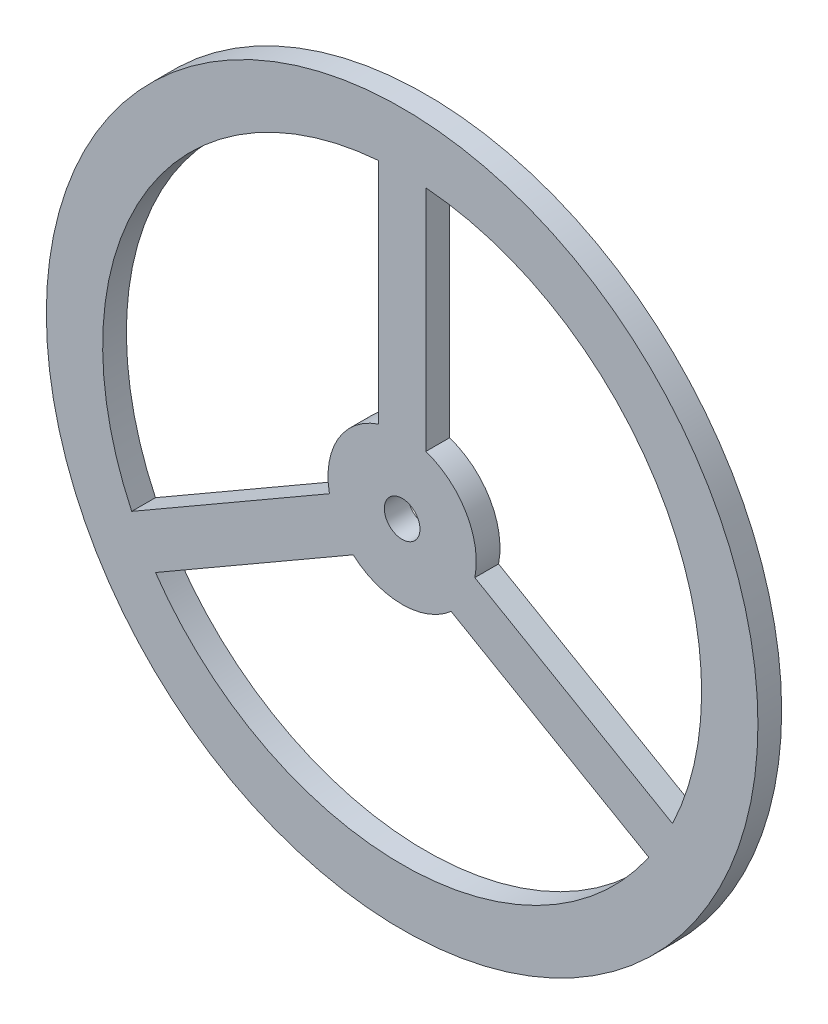
ISO-10303-21;
HEADER;
FILE_DESCRIPTION(('STEP AP214'),'2;1');
FILE_NAME('part.step','',(''),(''),'','','');
FILE_SCHEMA(('AUTOMOTIVE_DESIGN { 1 0 10303 214 1 1 1 1 }'));
ENDSEC;
DATA;
#1=APPLICATION_CONTEXT('core data for automotive mechanical design processes');
#2=APPLICATION_PROTOCOL_DEFINITION('international standard','automotive_design',2000,#1);
#3=PRODUCT_CONTEXT('',#1,'mechanical');
#4=PRODUCT('Part','Part','',(#3));
#5=PRODUCT_RELATED_PRODUCT_CATEGORY('part','',(#4));
#6=PRODUCT_DEFINITION_FORMATION('','',#4);
#7=PRODUCT_DEFINITION_CONTEXT('part definition',#1,'design');
#8=PRODUCT_DEFINITION('design','',#6,#7);
#9=PRODUCT_DEFINITION_SHAPE('','',#8);
#10=(LENGTH_UNIT() NAMED_UNIT(*) SI_UNIT(.MILLI.,.METRE.));
#11=(NAMED_UNIT(*) PLANE_ANGLE_UNIT() SI_UNIT($,.RADIAN.));
#12=(NAMED_UNIT(*) SI_UNIT($,.STERADIAN.) SOLID_ANGLE_UNIT());
#13=UNCERTAINTY_MEASURE_WITH_UNIT(LENGTH_MEASURE(1.E-05),#10,'distance_accuracy_value','');
#14=(GEOMETRIC_REPRESENTATION_CONTEXT(3) GLOBAL_UNCERTAINTY_ASSIGNED_CONTEXT((#13)) GLOBAL_UNIT_ASSIGNED_CONTEXT((#10,
#11,#12)) REPRESENTATION_CONTEXT('',''));
#15=CARTESIAN_POINT('',(0.,0.,0.));
#16=DIRECTION('',(0.,0.,1.));
#17=DIRECTION('',(1.,0.,0.));
#18=AXIS2_PLACEMENT_3D('',#15,#16,#17);
#19=CARTESIAN_POINT('',(0.,0.,4.));
#20=DIRECTION('',(0.,0.,1.));
#21=DIRECTION('',(1.,0.,0.));
#22=AXIS2_PLACEMENT_3D('',#19,#20,#21);
#23=PLANE('',#22);
#24=CARTESIAN_POINT('',(0.,0.,4.));
#25=DIRECTION('',(0.,0.,1.));
#26=DIRECTION('',(1.,0.,0.));
#27=AXIS2_PLACEMENT_3D('',#24,#25,#26);
#28=CIRCLE('',#27,60.);
#29=CARTESIAN_POINT('',(60.,0.,4.));
#30=VERTEX_POINT('',#29);
#31=EDGE_CURVE('E11',#30,#30,#28,.T.);
#32=ORIENTED_EDGE('',*,*,#31,.T.);
#33=EDGE_LOOP('',(#32));
#34=FACE_BOUND('',#33,.T.);
#35=CARTESIAN_POINT('',(0.,0.,4.));
#36=DIRECTION('',(0.,0.,1.));
#37=DIRECTION('',(1.,0.,0.));
#38=AXIS2_PLACEMENT_3D('',#35,#36,#37);
#39=CIRCLE('',#38,3.);
#40=CARTESIAN_POINT('',(3.,0.,4.));
#41=VERTEX_POINT('',#40);
#42=EDGE_CURVE('E220',#41,#41,#39,.T.);
#43=ORIENTED_EDGE('',*,*,#42,.F.);
#44=EDGE_LOOP('',(#43));
#45=FACE_BOUND('',#44,.T.);
#46=DIRECTION('',(0.,1.,0.));
#47=VECTOR('',#46,1.);
#48=CARTESIAN_POINT('',(-4.,11.842719282327,4.));
#49=LINE('',#48,#47);
#50=CARTESIAN_POINT('',(-4.,11.842719282327,4.));
#51=VERTEX_POINT('',#50);
#52=CARTESIAN_POINT('',(-4.,50.3413349048275,4.));
#53=VERTEX_POINT('',#52);
#54=EDGE_CURVE('E191',#51,#53,#49,.T.);
#55=ORIENTED_EDGE('',*,*,#54,.F.);
#56=CARTESIAN_POINT('',(0.,0.,4.));
#57=DIRECTION('',(0.,0.,-1.));
#58=DIRECTION('',(1.,0.,0.));
#59=AXIS2_PLACEMENT_3D('',#56,#57,#58);
#60=CIRCLE('',#59,12.5);
#61=CARTESIAN_POINT('',(-12.256095748383,-2.45725802602564,4.));
#62=VERTEX_POINT('',#61);
#63=EDGE_CURVE('E189',#62,#51,#60,.T.);
#64=ORIENTED_EDGE('',*,*,#63,.F.);
#65=DIRECTION('',(0.866025403784437,0.500000000000003,0.));
#66=VECTOR('',#65,1.);
#67=CARTESIAN_POINT('',(-12.256095748383,-2.45725802602564,4.));
#68=LINE('',#67,#66);
#69=CARTESIAN_POINT('',(-45.5968748880009,-21.706565837276,4.));
#70=VERTEX_POINT('',#69);
#71=EDGE_CURVE('E197',#70,#62,#68,.T.);
#72=ORIENTED_EDGE('',*,*,#71,.F.);
#73=CARTESIAN_POINT('',(0.,0.,4.));
#74=DIRECTION('',(0.,0.,1.));
#75=DIRECTION('',(1.,0.,0.));
#76=AXIS2_PLACEMENT_3D('',#73,#74,#75);
#77=CIRCLE('',#76,50.5);
#78=EDGE_CURVE('E194',#53,#70,#77,.T.);
#79=ORIENTED_EDGE('',*,*,#78,.F.);
#80=EDGE_LOOP('',(#55,#64,#72,#79));
#81=FACE_BOUND('',#80,.T.);
#82=DIRECTION('',(0.866025403784439,-0.499999999999998,0.));
#83=VECTOR('',#82,1.);
#84=CARTESIAN_POINT('',(12.256095748383,-2.45725802602581,4.));
#85=LINE('',#84,#83);
#86=CARTESIAN_POINT('',(12.256095748383,-2.45725802602581,4.));
#87=VERTEX_POINT('',#86);
#88=CARTESIAN_POINT('',(45.5968748880009,-21.706565837276,4.));
#89=VERTEX_POINT('',#88);
#90=EDGE_CURVE('E160',#87,#89,#85,.T.);
#91=ORIENTED_EDGE('',*,*,#90,.F.);
#92=CARTESIAN_POINT('',(0.,0.,4.));
#93=DIRECTION('',(0.,0.,-1.));
#94=DIRECTION('',(1.,0.,0.));
#95=AXIS2_PLACEMENT_3D('',#92,#93,#94);
#96=CIRCLE('',#95,12.5);
#97=CARTESIAN_POINT('',(4.,11.842719282327,4.));
#98=VERTEX_POINT('',#97);
#99=EDGE_CURVE('E158',#98,#87,#96,.T.);
#100=ORIENTED_EDGE('',*,*,#99,.F.);
#101=DIRECTION('',(0.,-1.,0.));
#102=VECTOR('',#101,1.);
#103=CARTESIAN_POINT('',(4.,11.842719282327,4.));
#104=LINE('',#103,#102);
#105=CARTESIAN_POINT('',(4.,50.3413349048275,4.));
#106=VERTEX_POINT('',#105);
#107=EDGE_CURVE('E166',#106,#98,#104,.T.);
#108=ORIENTED_EDGE('',*,*,#107,.F.);
#109=CARTESIAN_POINT('',(0.,0.,4.));
#110=DIRECTION('',(0.,0.,1.));
#111=DIRECTION('',(1.,0.,0.));
#112=AXIS2_PLACEMENT_3D('',#109,#110,#111);
#113=CIRCLE('',#112,50.5);
#114=EDGE_CURVE('E163',#89,#106,#113,.T.);
#115=ORIENTED_EDGE('',*,*,#114,.F.);
#116=EDGE_LOOP('',(#91,#100,#108,#115));
#117=FACE_BOUND('',#116,.T.);
#118=DIRECTION('',(-0.866025403784437,-0.500000000000003,0.));
#119=VECTOR('',#118,1.);
#120=CARTESIAN_POINT('',(-8.2560957483831,-9.38546125630118,4.));
#121=LINE('',#120,#119);
#122=CARTESIAN_POINT('',(-8.2560957483831,-9.38546125630118,4.));
#123=VERTEX_POINT('',#122);
#124=CARTESIAN_POINT('',(-41.5968748880009,-28.6347690675515,4.));
#125=VERTEX_POINT('',#124);
#126=EDGE_CURVE('E130',#123,#125,#121,.T.);
#127=ORIENTED_EDGE('',*,*,#126,.F.);
#128=CARTESIAN_POINT('',(0.,0.,4.));
#129=DIRECTION('',(0.,0.,-1.));
#130=DIRECTION('',(1.,0.,0.));
#131=AXIS2_PLACEMENT_3D('',#128,#129,#130);
#132=CIRCLE('',#131,12.5);
#133=CARTESIAN_POINT('',(8.25609574838296,-9.3854612563013,4.));
#134=VERTEX_POINT('',#133);
#135=EDGE_CURVE('E122',#134,#123,#132,.T.);
#136=ORIENTED_EDGE('',*,*,#135,.F.);
#137=DIRECTION('',(-0.86602540378444,0.499999999999999,0.));
#138=VECTOR('',#137,1.);
#139=CARTESIAN_POINT('',(8.25609574838296,-9.3854612563013,4.));
#140=LINE('',#139,#138);
#141=CARTESIAN_POINT('',(41.5968748880009,-28.6347690675515,4.));
#142=VERTEX_POINT('',#141);
#143=EDGE_CURVE('E144',#142,#134,#140,.T.);
#144=ORIENTED_EDGE('',*,*,#143,.F.);
#145=CARTESIAN_POINT('',(0.,0.,4.));
#146=DIRECTION('',(0.,0.,1.));
#147=DIRECTION('',(1.,0.,0.));
#148=AXIS2_PLACEMENT_3D('',#145,#146,#147);
#149=CIRCLE('',#148,50.5);
#150=EDGE_CURVE('E142',#125,#142,#149,.T.);
#151=ORIENTED_EDGE('',*,*,#150,.F.);
#152=EDGE_LOOP('',(#127,#136,#144,#151));
#153=FACE_BOUND('',#152,.T.);
#154=ADVANCED_FACE('F33',(#34,#45,#81,#117,#153),#23,.T.);
#155=CARTESIAN_POINT('',(0.,0.,0.));
#156=DIRECTION('',(0.,0.,1.));
#157=DIRECTION('',(1.,0.,0.));
#158=AXIS2_PLACEMENT_3D('',#155,#156,#157);
#159=PLANE('',#158);
#160=CARTESIAN_POINT('',(0.,0.,0.));
#161=DIRECTION('',(0.,0.,-1.));
#162=DIRECTION('',(1.,0.,0.));
#163=AXIS2_PLACEMENT_3D('',#160,#161,#162);
#164=CIRCLE('',#163,12.5);
#165=CARTESIAN_POINT('',(4.,11.842719282327,0.));
#166=VERTEX_POINT('',#165);
#167=CARTESIAN_POINT('',(12.256095748383,-2.45725802602581,0.));
#168=VERTEX_POINT('',#167);
#169=EDGE_CURVE('E138',#166,#168,#164,.T.);
#170=ORIENTED_EDGE('',*,*,#169,.T.);
#171=DIRECTION('',(0.866025403784439,-0.499999999999998,0.));
#172=VECTOR('',#171,1.);
#173=CARTESIAN_POINT('',(12.256095748383,-2.45725802602581,0.));
#174=LINE('',#173,#172);
#175=CARTESIAN_POINT('',(45.5968748880009,-21.706565837276,0.));
#176=VERTEX_POINT('',#175);
#177=EDGE_CURVE('E171',#168,#176,#174,.T.);
#178=ORIENTED_EDGE('',*,*,#177,.T.);
#179=CARTESIAN_POINT('',(0.,0.,0.));
#180=DIRECTION('',(0.,0.,1.));
#181=DIRECTION('',(1.,0.,0.));
#182=AXIS2_PLACEMENT_3D('',#179,#180,#181);
#183=CIRCLE('',#182,50.5);
#184=CARTESIAN_POINT('',(4.,50.3413349048275,0.));
#185=VERTEX_POINT('',#184);
#186=EDGE_CURVE('E174',#176,#185,#183,.T.);
#187=ORIENTED_EDGE('',*,*,#186,.T.);
#188=DIRECTION('',(0.,-1.,0.));
#189=VECTOR('',#188,1.);
#190=CARTESIAN_POINT('',(4.,11.842719282327,0.));
#191=LINE('',#190,#189);
#192=EDGE_CURVE('E161',#185,#166,#191,.T.);
#193=ORIENTED_EDGE('',*,*,#192,.T.);
#194=EDGE_LOOP('',(#170,#178,#187,#193));
#195=FACE_BOUND('',#194,.T.);
#196=CARTESIAN_POINT('',(0.,0.,0.));
#197=DIRECTION('',(0.,0.,1.));
#198=DIRECTION('',(1.,0.,0.));
#199=AXIS2_PLACEMENT_3D('',#196,#197,#198);
#200=CIRCLE('',#199,3.);
#201=CARTESIAN_POINT('',(3.,0.,0.));
#202=VERTEX_POINT('',#201);
#203=EDGE_CURVE('E219',#202,#202,#200,.T.);
#204=ORIENTED_EDGE('',*,*,#203,.T.);
#205=EDGE_LOOP('',(#204));
#206=FACE_BOUND('',#205,.T.);
#207=CARTESIAN_POINT('',(0.,0.,0.));
#208=DIRECTION('',(0.,0.,1.));
#209=DIRECTION('',(1.,0.,0.));
#210=AXIS2_PLACEMENT_3D('',#207,#208,#209);
#211=CIRCLE('',#210,60.);
#212=CARTESIAN_POINT('',(60.,0.,0.));
#213=VERTEX_POINT('',#212);
#214=EDGE_CURVE('E37',#213,#213,#211,.T.);
#215=ORIENTED_EDGE('',*,*,#214,.F.);
#216=EDGE_LOOP('',(#215));
#217=FACE_BOUND('',#216,.T.);
#218=CARTESIAN_POINT('',(0.,0.,0.));
#219=DIRECTION('',(0.,0.,-1.));
#220=DIRECTION('',(1.,0.,0.));
#221=AXIS2_PLACEMENT_3D('',#218,#219,#220);
#222=CIRCLE('',#221,12.5);
#223=CARTESIAN_POINT('',(-12.256095748383,-2.45725802602563,0.));
#224=VERTEX_POINT('',#223);
#225=CARTESIAN_POINT('',(-4.,11.842719282327,0.));
#226=VERTEX_POINT('',#225);
#227=EDGE_CURVE('E188',#224,#226,#222,.T.);
#228=ORIENTED_EDGE('',*,*,#227,.T.);
#229=DIRECTION('',(0.,1.,0.));
#230=VECTOR('',#229,1.);
#231=CARTESIAN_POINT('',(-4.,11.842719282327,0.));
#232=LINE('',#231,#230);
#233=CARTESIAN_POINT('',(-4.,50.3413349048275,0.));
#234=VERTEX_POINT('',#233);
#235=EDGE_CURVE('E202',#226,#234,#232,.T.);
#236=ORIENTED_EDGE('',*,*,#235,.T.);
#237=CARTESIAN_POINT('',(0.,0.,0.));
#238=DIRECTION('',(0.,0.,1.));
#239=DIRECTION('',(1.,0.,0.));
#240=AXIS2_PLACEMENT_3D('',#237,#238,#239);
#241=CIRCLE('',#240,50.5);
#242=CARTESIAN_POINT('',(-45.5968748880009,-21.706565837276,0.));
#243=VERTEX_POINT('',#242);
#244=EDGE_CURVE('E205',#234,#243,#241,.T.);
#245=ORIENTED_EDGE('',*,*,#244,.T.);
#246=DIRECTION('',(0.866025403784437,0.500000000000003,0.));
#247=VECTOR('',#246,1.);
#248=CARTESIAN_POINT('',(-12.256095748383,-2.45725802602564,0.));
#249=LINE('',#248,#247);
#250=EDGE_CURVE('E192',#243,#224,#249,.T.);
#251=ORIENTED_EDGE('',*,*,#250,.T.);
#252=EDGE_LOOP('',(#228,#236,#245,#251));
#253=FACE_BOUND('',#252,.T.);
#254=CARTESIAN_POINT('',(0.,0.,0.));
#255=DIRECTION('',(0.,0.,-1.));
#256=DIRECTION('',(1.,0.,0.));
#257=AXIS2_PLACEMENT_3D('',#254,#255,#256);
#258=CIRCLE('',#257,12.5);
#259=CARTESIAN_POINT('',(8.25609574838296,-9.3854612563013,0.));
#260=VERTEX_POINT('',#259);
#261=CARTESIAN_POINT('',(-8.2560957483831,-9.38546125630118,0.));
#262=VERTEX_POINT('',#261);
#263=EDGE_CURVE('E56',#260,#262,#258,.T.);
#264=ORIENTED_EDGE('',*,*,#263,.T.);
#265=DIRECTION('',(-0.866025403784437,-0.500000000000003,0.));
#266=VECTOR('',#265,1.);
#267=CARTESIAN_POINT('',(-8.2560957483831,-9.38546125630118,0.));
#268=LINE('',#267,#266);
#269=CARTESIAN_POINT('',(-41.5968748880009,-28.6347690675515,0.));
#270=VERTEX_POINT('',#269);
#271=EDGE_CURVE('E137',#262,#270,#268,.T.);
#272=ORIENTED_EDGE('',*,*,#271,.T.);
#273=CARTESIAN_POINT('',(0.,0.,0.));
#274=DIRECTION('',(0.,0.,1.));
#275=DIRECTION('',(1.,0.,0.));
#276=AXIS2_PLACEMENT_3D('',#273,#274,#275);
#277=CIRCLE('',#276,50.5);
#278=CARTESIAN_POINT('',(41.5968748880009,-28.6347690675515,0.));
#279=VERTEX_POINT('',#278);
#280=EDGE_CURVE('E150',#270,#279,#277,.T.);
#281=ORIENTED_EDGE('',*,*,#280,.T.);
#282=DIRECTION('',(-0.86602540378444,0.499999999999999,0.));
#283=VECTOR('',#282,1.);
#284=CARTESIAN_POINT('',(8.25609574838296,-9.3854612563013,0.));
#285=LINE('',#284,#283);
#286=EDGE_CURVE('E131',#279,#260,#285,.T.);
#287=ORIENTED_EDGE('',*,*,#286,.T.);
#288=EDGE_LOOP('',(#264,#272,#281,#287));
#289=FACE_BOUND('',#288,.T.);
#290=ADVANCED_FACE('F226',(#195,#206,#217,#253,#289),#159,.F.);
#291=CARTESIAN_POINT('',(0.,0.,4.));
#292=DIRECTION('',(0.,0.,-1.));
#293=DIRECTION('',(-1.,0.,0.));
#294=AXIS2_PLACEMENT_3D('',#291,#292,#293);
#295=CYLINDRICAL_SURFACE('',#294,60.);
#296=ORIENTED_EDGE('',*,*,#31,.F.);
#297=EDGE_LOOP('',(#296));
#298=FACE_BOUND('',#297,.T.);
#299=ORIENTED_EDGE('',*,*,#214,.T.);
#300=EDGE_LOOP('',(#299));
#301=FACE_BOUND('',#300,.T.);
#302=ADVANCED_FACE('F35',(#298,#301),#295,.T.);
#303=CARTESIAN_POINT('',(0.,0.,4.));
#304=DIRECTION('',(0.,0.,-1.));
#305=DIRECTION('',(-1.,0.,0.));
#306=AXIS2_PLACEMENT_3D('',#303,#304,#305);
#307=CYLINDRICAL_SURFACE('',#306,3.);
#308=ORIENTED_EDGE('',*,*,#42,.T.);
#309=EDGE_LOOP('',(#308));
#310=FACE_BOUND('',#309,.T.);
#311=ORIENTED_EDGE('',*,*,#203,.F.);
#312=EDGE_LOOP('',(#311));
#313=FACE_BOUND('',#312,.T.);
#314=ADVANCED_FACE('F229',(#310,#313),#307,.F.);
#315=CARTESIAN_POINT('',(0.,0.,4.));
#316=DIRECTION('',(0.,0.,-1.));
#317=DIRECTION('',(-1.,0.,0.));
#318=AXIS2_PLACEMENT_3D('',#315,#316,#317);
#319=CYLINDRICAL_SURFACE('',#318,12.5);
#320=ORIENTED_EDGE('',*,*,#227,.F.);
#321=DIRECTION('',(0.,0.,-1.));
#322=VECTOR('',#321,1.);
#323=CARTESIAN_POINT('',(-12.256095748383,-2.45725802602564,4.));
#324=LINE('',#323,#322);
#325=EDGE_CURVE('E199',#62,#224,#324,.T.);
#326=ORIENTED_EDGE('',*,*,#325,.F.);
#327=ORIENTED_EDGE('',*,*,#63,.T.);
#328=DIRECTION('',(0.,0.,-1.));
#329=VECTOR('',#328,1.);
#330=CARTESIAN_POINT('',(-4.,11.842719282327,4.));
#331=LINE('',#330,#329);
#332=EDGE_CURVE('E216',#51,#226,#331,.T.);
#333=ORIENTED_EDGE('',*,*,#332,.T.);
#334=EDGE_LOOP('',(#320,#326,#327,#333));
#335=FACE_BOUND('',#334,.T.);
#336=ADVANCED_FACE('F231',(#335),#319,.T.);
#337=CARTESIAN_POINT('',(-4.,11.842719282327,4.));
#338=DIRECTION('',(-1.,0.,0.));
#339=DIRECTION('',(0.,0.,1.));
#340=AXIS2_PLACEMENT_3D('',#337,#338,#339);
#341=PLANE('',#340);
#342=ORIENTED_EDGE('',*,*,#235,.F.);
#343=ORIENTED_EDGE('',*,*,#332,.F.);
#344=ORIENTED_EDGE('',*,*,#54,.T.);
#345=DIRECTION('',(0.,0.,-1.));
#346=VECTOR('',#345,1.);
#347=CARTESIAN_POINT('',(-4.,50.3413349048275,4.));
#348=LINE('',#347,#346);
#349=EDGE_CURVE('E214',#53,#234,#348,.T.);
#350=ORIENTED_EDGE('',*,*,#349,.T.);
#351=EDGE_LOOP('',(#342,#343,#344,#350));
#352=FACE_BOUND('',#351,.T.);
#353=ADVANCED_FACE('F238',(#352),#341,.T.);
#354=CARTESIAN_POINT('',(0.,0.,4.));
#355=DIRECTION('',(0.,0.,-1.));
#356=DIRECTION('',(-1.,0.,0.));
#357=AXIS2_PLACEMENT_3D('',#354,#355,#356);
#358=CYLINDRICAL_SURFACE('',#357,50.5);
#359=ORIENTED_EDGE('',*,*,#244,.F.);
#360=ORIENTED_EDGE('',*,*,#349,.F.);
#361=ORIENTED_EDGE('',*,*,#78,.T.);
#362=DIRECTION('',(0.,0.,-1.));
#363=VECTOR('',#362,1.);
#364=CARTESIAN_POINT('',(-45.5968748880009,-21.706565837276,4.));
#365=LINE('',#364,#363);
#366=EDGE_CURVE('E212',#70,#243,#365,.T.);
#367=ORIENTED_EDGE('',*,*,#366,.T.);
#368=EDGE_LOOP('',(#359,#360,#361,#367));
#369=FACE_BOUND('',#368,.T.);
#370=ADVANCED_FACE('F291',(#369),#358,.F.);
#371=CARTESIAN_POINT('',(-12.256095748383,-2.45725802602564,4.));
#372=DIRECTION('',(-0.500000000000003,0.866025403784437,0.));
#373=DIRECTION('',(-0.866025403784437,-0.500000000000003,0.));
#374=AXIS2_PLACEMENT_3D('',#371,#372,#373);
#375=PLANE('',#374);
#376=ORIENTED_EDGE('',*,*,#250,.F.);
#377=ORIENTED_EDGE('',*,*,#366,.F.);
#378=ORIENTED_EDGE('',*,*,#71,.T.);
#379=ORIENTED_EDGE('',*,*,#325,.T.);
#380=EDGE_LOOP('',(#376,#377,#378,#379));
#381=FACE_BOUND('',#380,.T.);
#382=ADVANCED_FACE('F288',(#381),#375,.T.);
#383=CARTESIAN_POINT('',(0.,0.,4.));
#384=DIRECTION('',(0.,0.,-1.));
#385=DIRECTION('',(-1.,0.,0.));
#386=AXIS2_PLACEMENT_3D('',#383,#384,#385);
#387=CYLINDRICAL_SURFACE('',#386,12.5);
#388=ORIENTED_EDGE('',*,*,#169,.F.);
#389=DIRECTION('',(0.,0.,-1.));
#390=VECTOR('',#389,1.);
#391=CARTESIAN_POINT('',(4.,11.842719282327,4.));
#392=LINE('',#391,#390);
#393=EDGE_CURVE('E168',#98,#166,#392,.T.);
#394=ORIENTED_EDGE('',*,*,#393,.F.);
#395=ORIENTED_EDGE('',*,*,#99,.T.);
#396=DIRECTION('',(0.,0.,-1.));
#397=VECTOR('',#396,1.);
#398=CARTESIAN_POINT('',(12.256095748383,-2.45725802602581,4.));
#399=LINE('',#398,#397);
#400=EDGE_CURVE('E185',#87,#168,#399,.T.);
#401=ORIENTED_EDGE('',*,*,#400,.T.);
#402=EDGE_LOOP('',(#388,#394,#395,#401));
#403=FACE_BOUND('',#402,.T.);
#404=ADVANCED_FACE('F270',(#403),#387,.T.);
#405=CARTESIAN_POINT('',(12.256095748383,-2.45725802602581,4.));
#406=DIRECTION('',(0.499999999999999,0.866025403784439,0.));
#407=DIRECTION('',(-0.866025403784439,0.499999999999999,0.));
#408=AXIS2_PLACEMENT_3D('',#405,#406,#407);
#409=PLANE('',#408);
#410=ORIENTED_EDGE('',*,*,#177,.F.);
#411=ORIENTED_EDGE('',*,*,#400,.F.);
#412=ORIENTED_EDGE('',*,*,#90,.T.);
#413=DIRECTION('',(0.,0.,-1.));
#414=VECTOR('',#413,1.);
#415=CARTESIAN_POINT('',(45.5968748880009,-21.706565837276,4.));
#416=LINE('',#415,#414);
#417=EDGE_CURVE('E183',#89,#176,#416,.T.);
#418=ORIENTED_EDGE('',*,*,#417,.T.);
#419=EDGE_LOOP('',(#410,#411,#412,#418));
#420=FACE_BOUND('',#419,.T.);
#421=ADVANCED_FACE('F264',(#420),#409,.T.);
#422=CARTESIAN_POINT('',(0.,0.,4.));
#423=DIRECTION('',(0.,0.,-1.));
#424=DIRECTION('',(-1.,0.,0.));
#425=AXIS2_PLACEMENT_3D('',#422,#423,#424);
#426=CYLINDRICAL_SURFACE('',#425,50.5);
#427=ORIENTED_EDGE('',*,*,#186,.F.);
#428=ORIENTED_EDGE('',*,*,#417,.F.);
#429=ORIENTED_EDGE('',*,*,#114,.T.);
#430=DIRECTION('',(0.,0.,-1.));
#431=VECTOR('',#430,1.);
#432=CARTESIAN_POINT('',(4.,50.3413349048275,4.));
#433=LINE('',#432,#431);
#434=EDGE_CURVE('E181',#106,#185,#433,.T.);
#435=ORIENTED_EDGE('',*,*,#434,.T.);
#436=EDGE_LOOP('',(#427,#428,#429,#435));
#437=FACE_BOUND('',#436,.T.);
#438=ADVANCED_FACE('F267',(#437),#426,.F.);
#439=CARTESIAN_POINT('',(4.,11.842719282327,4.));
#440=DIRECTION('',(1.,0.,0.));
#441=DIRECTION('',(0.,0.,-1.));
#442=AXIS2_PLACEMENT_3D('',#439,#440,#441);
#443=PLANE('',#442);
#444=ORIENTED_EDGE('',*,*,#192,.F.);
#445=ORIENTED_EDGE('',*,*,#434,.F.);
#446=ORIENTED_EDGE('',*,*,#107,.T.);
#447=ORIENTED_EDGE('',*,*,#393,.T.);
#448=EDGE_LOOP('',(#444,#445,#446,#447));
#449=FACE_BOUND('',#448,.T.);
#450=ADVANCED_FACE('F273',(#449),#443,.T.);
#451=CARTESIAN_POINT('',(0.,0.,4.));
#452=DIRECTION('',(0.,0.,-1.));
#453=DIRECTION('',(-1.,0.,0.));
#454=AXIS2_PLACEMENT_3D('',#451,#452,#453);
#455=CYLINDRICAL_SURFACE('',#454,12.5);
#456=ORIENTED_EDGE('',*,*,#263,.F.);
#457=DIRECTION('',(0.,0.,-1.));
#458=VECTOR('',#457,1.);
#459=CARTESIAN_POINT('',(8.25609574838296,-9.3854612563013,4.));
#460=LINE('',#459,#458);
#461=EDGE_CURVE('E126',#134,#260,#460,.T.);
#462=ORIENTED_EDGE('',*,*,#461,.F.);
#463=ORIENTED_EDGE('',*,*,#135,.T.);
#464=DIRECTION('',(0.,0.,-1.));
#465=VECTOR('',#464,1.);
#466=CARTESIAN_POINT('',(-8.2560957483831,-9.38546125630118,4.));
#467=LINE('',#466,#465);
#468=EDGE_CURVE('E125',#123,#262,#467,.T.);
#469=ORIENTED_EDGE('',*,*,#468,.T.);
#470=EDGE_LOOP('',(#456,#462,#463,#469));
#471=FACE_BOUND('',#470,.T.);
#472=ADVANCED_FACE('F124',(#471),#455,.T.);
#473=CARTESIAN_POINT('',(-8.2560957483831,-9.38546125630118,4.));
#474=DIRECTION('',(0.500000000000003,-0.866025403784437,0.));
#475=DIRECTION('',(0.866025403784437,0.500000000000003,0.));
#476=AXIS2_PLACEMENT_3D('',#473,#474,#475);
#477=PLANE('',#476);
#478=ORIENTED_EDGE('',*,*,#271,.F.);
#479=ORIENTED_EDGE('',*,*,#468,.F.);
#480=ORIENTED_EDGE('',*,*,#126,.T.);
#481=DIRECTION('',(0.,0.,-1.));
#482=VECTOR('',#481,1.);
#483=CARTESIAN_POINT('',(-41.5968748880009,-28.6347690675515,4.));
#484=LINE('',#483,#482);
#485=EDGE_CURVE('E139',#125,#270,#484,.T.);
#486=ORIENTED_EDGE('',*,*,#485,.T.);
#487=EDGE_LOOP('',(#478,#479,#480,#486));
#488=FACE_BOUND('',#487,.T.);
#489=ADVANCED_FACE('F134',(#488),#477,.T.);
#490=CARTESIAN_POINT('',(0.,0.,4.));
#491=DIRECTION('',(0.,0.,-1.));
#492=DIRECTION('',(-1.,0.,0.));
#493=AXIS2_PLACEMENT_3D('',#490,#491,#492);
#494=CYLINDRICAL_SURFACE('',#493,50.5);
#495=ORIENTED_EDGE('',*,*,#280,.F.);
#496=ORIENTED_EDGE('',*,*,#485,.F.);
#497=ORIENTED_EDGE('',*,*,#150,.T.);
#498=DIRECTION('',(0.,0.,-1.));
#499=VECTOR('',#498,1.);
#500=CARTESIAN_POINT('',(41.5968748880009,-28.6347690675515,4.));
#501=LINE('',#500,#499);
#502=EDGE_CURVE('E48',#142,#279,#501,.T.);
#503=ORIENTED_EDGE('',*,*,#502,.T.);
#504=EDGE_LOOP('',(#495,#496,#497,#503));
#505=FACE_BOUND('',#504,.T.);
#506=ADVANCED_FACE('F311',(#505),#494,.F.);
#507=CARTESIAN_POINT('',(8.25609574838296,-9.3854612563013,4.));
#508=DIRECTION('',(-0.499999999999999,-0.866025403784439,0.));
#509=DIRECTION('',(0.866025403784439,-0.499999999999999,0.));
#510=AXIS2_PLACEMENT_3D('',#507,#508,#509);
#511=PLANE('',#510);
#512=ORIENTED_EDGE('',*,*,#286,.F.);
#513=ORIENTED_EDGE('',*,*,#502,.F.);
#514=ORIENTED_EDGE('',*,*,#143,.T.);
#515=ORIENTED_EDGE('',*,*,#461,.T.);
#516=EDGE_LOOP('',(#512,#513,#514,#515));
#517=FACE_BOUND('',#516,.T.);
#518=ADVANCED_FACE('F309',(#517),#511,.T.);
#519=CLOSED_SHELL('',(#154,#290,#302,#314,#336,#353,#370,#382,#404,#421,#438,#450,#472,#489,
#506,#518));
#520=MANIFOLD_SOLID_BREP('B2',#519);
#521=ADVANCED_BREP_SHAPE_REPRESENTATION('',(#18,#520),#14);
#522=SHAPE_DEFINITION_REPRESENTATION(#9,#521);
ENDSEC;
END-ISO-10303-21;
